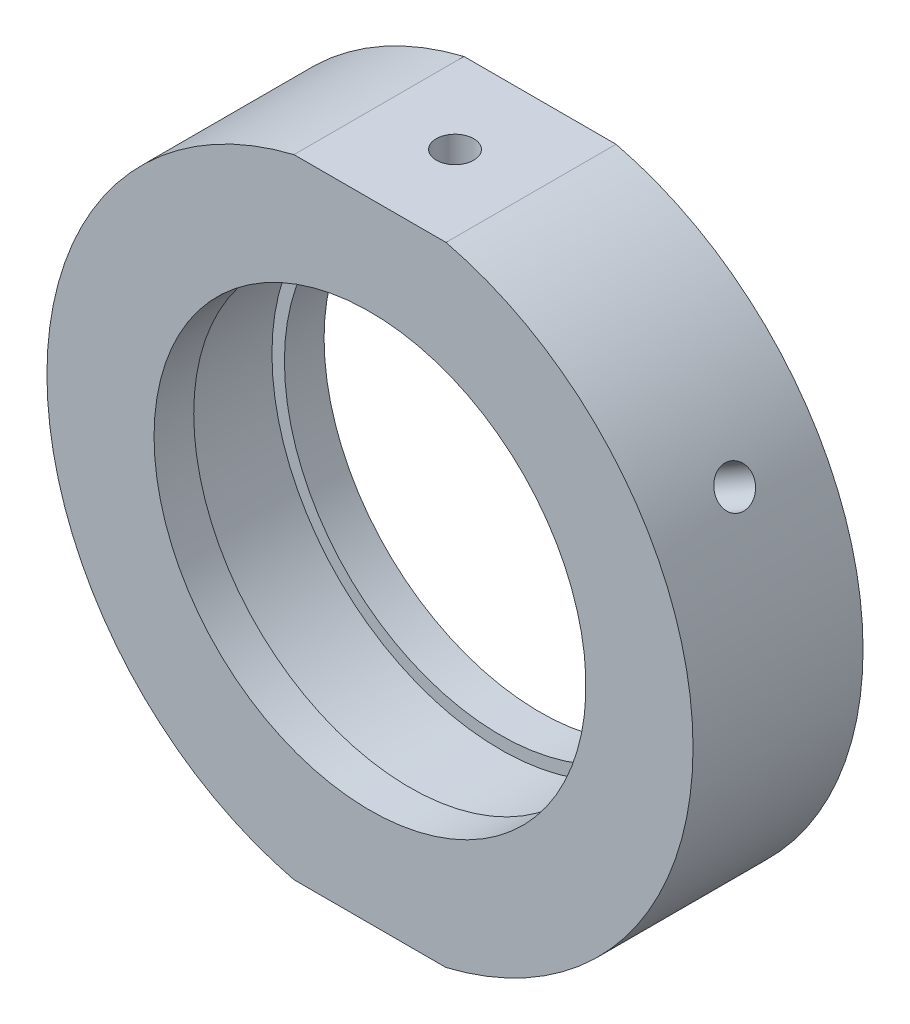
ISO-10303-21;
HEADER;
FILE_DESCRIPTION(('STEP AP214'),'2;1');
FILE_NAME('part.step','',(''),(''),'','','');
FILE_SCHEMA(('AUTOMOTIVE_DESIGN { 1 0 10303 214 1 1 1 1 }'));
ENDSEC;
DATA;
#1=APPLICATION_CONTEXT('core data for automotive mechanical design processes');
#2=APPLICATION_PROTOCOL_DEFINITION('international standard','automotive_design',2000,#1);
#3=PRODUCT_CONTEXT('',#1,'mechanical');
#4=PRODUCT('Part','Part','',(#3));
#5=PRODUCT_RELATED_PRODUCT_CATEGORY('part','',(#4));
#6=PRODUCT_DEFINITION_FORMATION('','',#4);
#7=PRODUCT_DEFINITION_CONTEXT('part definition',#1,'design');
#8=PRODUCT_DEFINITION('design','',#6,#7);
#9=PRODUCT_DEFINITION_SHAPE('','',#8);
#10=(LENGTH_UNIT() NAMED_UNIT(*) SI_UNIT(.MILLI.,.METRE.));
#11=(NAMED_UNIT(*) PLANE_ANGLE_UNIT() SI_UNIT($,.RADIAN.));
#12=(NAMED_UNIT(*) SI_UNIT($,.STERADIAN.) SOLID_ANGLE_UNIT());
#13=UNCERTAINTY_MEASURE_WITH_UNIT(LENGTH_MEASURE(1.E-05),#10,'distance_accuracy_value','');
#14=(GEOMETRIC_REPRESENTATION_CONTEXT(3) GLOBAL_UNCERTAINTY_ASSIGNED_CONTEXT((#13)) GLOBAL_UNIT_ASSIGNED_CONTEXT((#10,
#11,#12)) REPRESENTATION_CONTEXT('',''));
#15=CARTESIAN_POINT('',(0.,0.,0.));
#16=DIRECTION('',(0.,0.,1.));
#17=DIRECTION('',(1.,0.,0.));
#18=AXIS2_PLACEMENT_3D('',#15,#16,#17);
#19=CARTESIAN_POINT('',(0.,0.,-31.9390681003584));
#20=DIRECTION('',(0.,0.,-1.));
#21=DIRECTION('',(-1.,0.,0.));
#22=AXIS2_PLACEMENT_3D('',#19,#20,#21);
#23=CYLINDRICAL_SURFACE('',#22,28.5);
#24=CARTESIAN_POINT('',(23.8153251804841,15.6550402921169,0.));
#25=CARTESIAN_POINT('',(23.8153277749308,15.6550370795243,-0.0925978594208507));
#26=CARTESIAN_POINT('',(23.8196314005314,15.648495501609,-0.185260883687119));
#27=CARTESIAN_POINT('',(23.8367053720121,15.6224745102445,-0.368029223496932));
#28=CARTESIAN_POINT('',(23.8494856204936,15.6029799647694,-0.458131418877637));
#29=CARTESIAN_POINT('',(23.883047908846,15.5515581135897,-0.633104162038931));
#30=CARTESIAN_POINT('',(23.9038257819431,15.5196372818995,-0.717977407442433));
#31=CARTESIAN_POINT('',(23.9526385469314,15.4441935848521,-0.880112571888854));
#32=CARTESIAN_POINT('',(23.9806717568717,15.4006734084152,-0.957376249277912));
#33=CARTESIAN_POINT('',(24.0430562144596,15.3030975605881,-1.10222274019426));
#34=CARTESIAN_POINT('',(24.0774147044993,15.249029808035,-1.16979429691297));
#35=CARTESIAN_POINT('',(24.1512594901974,15.1318027254734,-1.29324222428016));
#36=CARTESIAN_POINT('',(24.1907459978167,15.0686430196475,-1.34911811125169));
#37=CARTESIAN_POINT('',(24.2735675116473,14.9348620430341,-1.44762184788487));
#38=CARTESIAN_POINT('',(24.3169051374035,14.8642356871119,-1.49024058992058));
#39=CARTESIAN_POINT('',(24.4060146047625,14.7174662889455,-1.56096188486543));
#40=CARTESIAN_POINT('',(24.4517864233173,14.6413232989326,-1.58906457519159));
#41=CARTESIAN_POINT('',(24.5442958347122,14.485707503826,-1.62992536658153));
#42=CARTESIAN_POINT('',(24.5910322755923,14.4062385658194,-1.6427008024291));
#43=CARTESIAN_POINT('',(24.6841374618096,14.2461199296046,-1.65259795617057));
#44=CARTESIAN_POINT('',(24.7305062107939,14.1654702431304,-1.64971982952272));
#45=CARTESIAN_POINT('',(24.8215140418881,14.0053886164006,-1.62840588898168));
#46=CARTESIAN_POINT('',(24.8661551305039,13.9259553324556,-1.60998872611444));
#47=CARTESIAN_POINT('',(24.9525779635914,13.7705035188194,-1.55814843979011));
#48=CARTESIAN_POINT('',(24.9943596930856,13.6944850070158,-1.52472523773761));
#49=CARTESIAN_POINT('',(25.074039297685,13.5480446573406,-1.4438004575266));
#50=CARTESIAN_POINT('',(25.1119348175524,13.4776262191303,-1.39629040910615));
#51=CARTESIAN_POINT('',(25.1829180740113,13.3445245637642,-1.28854674262331));
#52=CARTESIAN_POINT('',(25.216005764436,13.2818414208868,-1.2283130023963));
#53=CARTESIAN_POINT('',(25.276680390478,13.1660062212325,-1.0967263901019));
#54=CARTESIAN_POINT('',(25.3042591835338,13.1128682844896,-1.02535733248248));
#55=CARTESIAN_POINT('',(25.3532699045685,13.0178559055621,-0.873582757263182));
#56=CARTESIAN_POINT('',(25.3747018304519,12.9759814672176,-0.793177236582499));
#57=CARTESIAN_POINT('',(25.4109837632356,12.9047862721655,-0.625601997467238));
#58=CARTESIAN_POINT('',(25.4258334645658,12.8754660982736,-0.538431965220725));
#59=CARTESIAN_POINT('',(25.4486562491563,12.8302977764119,-0.359806768278471));
#60=CARTESIAN_POINT('',(25.4566294017861,12.8144494925396,-0.268351646819872));
#61=CARTESIAN_POINT('',(25.465538390234,12.7967360980451,-0.083894449338307));
#62=CARTESIAN_POINT('',(25.4664844223332,12.794850727388,0.00910518900747107));
#63=CARTESIAN_POINT('',(25.4613479608896,12.8050689748372,0.194136416173908));
#64=CARTESIAN_POINT('',(25.4552654986569,12.8171725306264,0.286168009305117));
#65=CARTESIAN_POINT('',(25.4361958173778,12.8549751225273,0.466586842761183));
#66=CARTESIAN_POINT('',(25.4232133159397,12.8806648695991,0.554976528647747));
#67=CARTESIAN_POINT('',(25.3905999866401,12.9448337250359,0.725677915191169));
#68=CARTESIAN_POINT('',(25.3709691070619,12.9833129328883,0.807989568561868));
#69=CARTESIAN_POINT('',(25.325426555806,13.0719258258635,0.964302442341509));
#70=CARTESIAN_POINT('',(25.299507674783,13.1220728857392,1.03829397999781));
#71=CARTESIAN_POINT('',(25.2419427594548,13.2324672925696,1.17576878931791));
#72=CARTESIAN_POINT('',(25.2102966767578,13.2927147248668,1.23925197218311));
#73=CARTESIAN_POINT('',(25.1419318668708,13.4215713534383,1.35398434922265));
#74=CARTESIAN_POINT('',(25.1052071503995,13.490190411028,1.40521890087996));
#75=CARTESIAN_POINT('',(25.0275705469147,13.6336846873921,1.49389949694827));
#76=CARTESIAN_POINT('',(24.9866586827456,13.7085598720337,1.53134561658169));
#77=CARTESIAN_POINT('',(24.9016885882841,13.8623089314004,1.59136086739738));
#78=CARTESIAN_POINT('',(24.8576323454282,13.9411802713268,1.61393930515066));
#79=CARTESIAN_POINT('',(24.7675098427044,14.1006681486337,1.64360873795477));
#80=CARTESIAN_POINT('',(24.7214435992881,14.1812846717273,1.65069985974244));
#81=CARTESIAN_POINT('',(24.6286511043687,14.3418314405987,1.6491921616015));
#82=CARTESIAN_POINT('',(24.5819259168648,14.4217625177426,1.64061627710614));
#83=CARTESIAN_POINT('',(24.4891127337376,14.578809299921,1.6080655031604));
#84=CARTESIAN_POINT('',(24.4430247392691,14.6559249998534,1.58409058580486));
#85=CARTESIAN_POINT('',(24.3528909190879,14.805212368933,1.52142731292838));
#86=CARTESIAN_POINT('',(24.3088450919138,14.8773840416183,1.4827389679373));
#87=CARTESIAN_POINT('',(24.2241909586551,15.014829187217,1.39175049167336));
#88=CARTESIAN_POINT('',(24.1835825570161,15.0801028518958,1.33945073893903));
#89=CARTESIAN_POINT('',(24.1070787364025,15.2021036707577,1.2226400736398));
#90=CARTESIAN_POINT('',(24.071189757745,15.2588191613504,1.15811276186068));
#91=CARTESIAN_POINT('',(24.0053942654022,15.3621225072457,1.01869728937211));
#92=CARTESIAN_POINT('',(23.9754892210139,15.4087078754379,0.94380659165079));
#93=CARTESIAN_POINT('',(23.9226815656073,15.4905677684456,0.785715198598314));
#94=CARTESIAN_POINT('',(23.8997869013468,15.5258294592687,0.702505213408065));
#95=CARTESIAN_POINT('',(23.8618810776424,15.5840254408833,0.53026564620262));
#96=CARTESIAN_POINT('',(23.846860654162,15.6069742185544,0.441243042086115));
#97=CARTESIAN_POINT('',(23.8291633179954,15.6339733166283,0.293060355475162));
#98=CARTESIAN_POINT('',(23.82398218144,15.6418641270648,0.234858919179984));
#99=CARTESIAN_POINT('',(23.8170622895183,15.6523986335215,0.117780444365869));
#100=CARTESIAN_POINT('',(23.815323530103,15.6550423357132,0.0589034066416474));
#101=CARTESIAN_POINT('',(23.8153251804841,15.6550402921169,0.));
#102=B_SPLINE_CURVE_WITH_KNOTS('',3,(#24,#25,#26,#27,#28,#29,#30,#31,#32,#33,#34,#35,#36,#37,
#38,#39,#40,#41,#42,#43,#44,#45,#46,#47,#48,#49,#50,#51,#52,#53,#54,#55,#56,#57,#58,#59,#60,#61,
#62,#63,#64,#65,#66,#67,#68,#69,#70,#71,#72,#73,#74,#75,#76,#77,#78,#79,#80,#81,#82,#83,#84,#85,
#86,#87,#88,#89,#90,#91,#92,#93,#94,#95,#96,#97,#98,#99,#100,#101),.UNSPECIFIED.,.T.,.F.,(4,2,2,
2,2,2,2,2,2,2,2,2,2,2,2,2,2,2,2,2,2,2,2,2,2,2,2,2,2,2,2,2,2,2,2,2,2,2,4),(0.,0.277578549691202,
0.555481946042684,0.833240749883355,1.11093522055068,1.38894964922938,1.6669755729844,
1.94519208016562,2.22340595354616,2.5013048757095,2.77920103801548,3.05676412385136,
3.33432866346455,3.61206043913667,3.88979488153022,4.16793684700293,4.44607890730273,
4.72423387859201,5.00238604386322,5.28013453415683,5.55788178715729,5.83543938610867,
6.1129991441881,6.39087864776975,6.6687604993925,6.94697289965534,7.22518378211565,
7.5032203497858,7.78125464220028,8.05888223740865,8.33651033571789,8.61413823533922,
8.89175841484567,9.16975359929351,9.44781695923016,9.72619436645998,10.0042435237498,
10.1808171672527,10.357390603072),.UNSPECIFIED.);
#103=CARTESIAN_POINT('',(23.8153251804841,15.6550402921169,0.));
#104=VERTEX_POINT('',#103);
#105=EDGE_CURVE('E11',#104,#104,#102,.T.);
#106=ORIENTED_EDGE('',*,*,#105,.T.);
#107=EDGE_LOOP('',(#106));
#108=FACE_BOUND('',#107,.T.);
#109=CARTESIAN_POINT('',(0.,0.,7.50000000000001));
#110=DIRECTION('',(0.,0.,-1.));
#111=DIRECTION('',(-1.,0.,0.));
#112=AXIS2_PLACEMENT_3D('',#109,#110,#111);
#113=CIRCLE('',#112,28.5);
#114=CARTESIAN_POINT('',(6.7052218456961,27.7,7.5));
#115=VERTEX_POINT('',#114);
#116=CARTESIAN_POINT('',(6.7052218456961,-27.7,7.50000000000001));
#117=VERTEX_POINT('',#116);
#118=EDGE_CURVE('E144',#115,#117,#113,.T.);
#119=ORIENTED_EDGE('',*,*,#118,.T.);
#120=DIRECTION('',(0.,0.,-1.));
#121=VECTOR('',#120,1.);
#122=CARTESIAN_POINT('',(6.7052218456961,-27.7,-31.9390681003584));
#123=LINE('',#122,#121);
#124=CARTESIAN_POINT('',(6.70522184569608,-27.7,-7.5));
#125=VERTEX_POINT('',#124);
#126=EDGE_CURVE('E57',#117,#125,#123,.T.);
#127=ORIENTED_EDGE('',*,*,#126,.T.);
#128=CARTESIAN_POINT('',(0.,0.,-7.5));
#129=DIRECTION('',(0.,0.,-1.));
#130=DIRECTION('',(-1.,0.,0.));
#131=AXIS2_PLACEMENT_3D('',#128,#129,#130);
#132=CIRCLE('',#131,28.5);
#133=CARTESIAN_POINT('',(6.7052218456961,27.7,-7.49999999999999));
#134=VERTEX_POINT('',#133);
#135=EDGE_CURVE('E148',#134,#125,#132,.T.);
#136=ORIENTED_EDGE('',*,*,#135,.F.);
#137=DIRECTION('',(0.,0.,-1.));
#138=VECTOR('',#137,1.);
#139=CARTESIAN_POINT('',(6.7052218456961,27.7,-31.9390681003584));
#140=LINE('',#139,#138);
#141=EDGE_CURVE('E118',#134,#115,#140,.F.);
#142=ORIENTED_EDGE('',*,*,#141,.T.);
#143=EDGE_LOOP('',(#119,#127,#136,#142));
#144=FACE_BOUND('',#143,.T.);
#145=ADVANCED_FACE('F37',(#108,#144),#23,.T.);
#146=CARTESIAN_POINT('',(19.05,0.,-7.5));
#147=DIRECTION('',(0.,0.,1.));
#148=DIRECTION('',(1.,0.,0.));
#149=AXIS2_PLACEMENT_3D('',#146,#147,#148);
#150=PLANE('',#149);
#151=CARTESIAN_POINT('',(0.,0.,-7.5));
#152=DIRECTION('',(0.,0.,-1.));
#153=DIRECTION('',(-1.,0.,0.));
#154=AXIS2_PLACEMENT_3D('',#151,#152,#153);
#155=CIRCLE('',#154,19.05);
#156=CARTESIAN_POINT('',(-19.05,0.,-7.5));
#157=VERTEX_POINT('',#156);
#158=EDGE_CURVE('E126',#157,#157,#155,.T.);
#159=ORIENTED_EDGE('',*,*,#158,.F.);
#160=EDGE_LOOP('',(#159));
#161=FACE_BOUND('',#160,.T.);
#162=ORIENTED_EDGE('',*,*,#135,.T.);
#163=DIRECTION('',(-1.,0.,0.));
#164=VECTOR('',#163,1.);
#165=CARTESIAN_POINT('',(19.05,-27.7,-7.5));
#166=LINE('',#165,#164);
#167=CARTESIAN_POINT('',(-6.7052218456961,-27.7,-7.49999999999999));
#168=VERTEX_POINT('',#167);
#169=EDGE_CURVE('E114',#125,#168,#166,.T.);
#170=ORIENTED_EDGE('',*,*,#169,.T.);
#171=CARTESIAN_POINT('',(-6.70522184569608,27.7,-7.5));
#172=VERTEX_POINT('',#171);
#173=EDGE_CURVE('E147',#168,#172,#132,.T.);
#174=ORIENTED_EDGE('',*,*,#173,.T.);
#175=DIRECTION('',(1.,0.,0.));
#176=VECTOR('',#175,1.);
#177=CARTESIAN_POINT('',(19.05,27.7,-7.5));
#178=LINE('',#177,#176);
#179=EDGE_CURVE('E121',#172,#134,#178,.T.);
#180=ORIENTED_EDGE('',*,*,#179,.T.);
#181=EDGE_LOOP('',(#162,#170,#174,#180));
#182=FACE_BOUND('',#181,.T.);
#183=ADVANCED_FACE('F39',(#161,#182),#150,.F.);
#184=CARTESIAN_POINT('',(-25.4653251804841,12.7971564596282,0.));
#185=CARTESIAN_POINT('',(-25.4653236955207,12.7971603127813,-0.0925978594208504));
#186=CARTESIAN_POINT('',(-25.4618103356655,12.8041581508374,-0.185260883687118));
#187=CARTESIAN_POINT('',(-25.4478124818525,12.8319551395655,-0.368029223496932));
#188=CARTESIAN_POINT('',(-25.4373198344766,12.8527704321546,-0.458131418877637));
#189=CARTESIAN_POINT('',(-25.4095683492215,12.9075471520668,-0.633104162038931));
#190=CARTESIAN_POINT('',(-25.3923130346165,12.9415017338507,-0.717977407442435));
#191=CARTESIAN_POINT('',(-25.3513832589122,13.0214966768832,-0.880112571888855));
#192=CARTESIAN_POINT('',(-25.3277102855108,13.0675342370595,-0.957376249277913));
#193=CARTESIAN_POINT('',(-25.2743993512906,13.1703486860455,-1.10222274019426));
#194=CARTESIAN_POINT('',(-25.2447545490739,13.2271378875321,-1.16979429691297));
#195=CARTESIAN_POINT('',(-25.1801553104131,13.3497028891645,-1.29324222428016));
#196=CARTESIAN_POINT('',(-25.145200654482,13.4154790607825,-1.34911811125169));
#197=CARTESIAN_POINT('',(-25.070753687107,13.5540950840463,-1.44762184788487));
#198=CARTESIAN_POINT('',(-25.0312582815798,13.626939746852,-1.49024058992058));
#199=CARTESIAN_POINT('',(-24.948706987949,13.7774955083858,-1.56096188486543));
#200=CARTESIAN_POINT('',(-24.9056511335551,13.8552065610382,-1.58906457519159));
#201=CARTESIAN_POINT('',(-24.8171386074601,14.0131299589486,-1.62992536658153));
#202=CARTESIAN_POINT('',(-24.7716847087747,14.0933393730365,-1.6427008024291));
#203=CARTESIAN_POINT('',(-24.679570495302,14.2540301476322,-1.65259795617057));
#204=CARTESIAN_POINT('',(-24.6329101925002,14.3345115054314,-1.64971982952272));
#205=CARTESIAN_POINT('',(-24.5397793526202,14.4933674124672,-1.62840588898168));
#206=CARTESIAN_POINT('',(-24.4933086551257,14.5717443712336,-1.60998872611444));
#207=CARTESIAN_POINT('',(-24.4018948519962,14.7243146469725,-1.55814843979012));
#208=CARTESIAN_POINT('',(-24.3569517543635,14.7985079420303,-1.52472523773762));
#209=CARTESIAN_POINT('',(-24.2699704937053,14.9407326786145,-1.4438004575266));
#210=CARTESIAN_POINT('',(-24.2279340972541,15.0087603806144,-1.39629040910615));
#211=CARTESIAN_POINT('',(-24.1481563106508,15.1367845116342,-1.28854674262331));
#212=CARTESIAN_POINT('',(-24.1104149617422,15.1967808635333,-1.2283130023963));
#213=CARTESIAN_POINT('',(-24.0404360492101,15.3072442308779,-1.0967263901019));
#214=CARTESIAN_POINT('',(-24.008206642614,15.3576971346413,-1.02535733248248));
#215=CARTESIAN_POINT('',(-23.9504288693062,15.447647853579,-0.873582757263181));
#216=CARTESIAN_POINT('',(-23.9248805048723,15.4871456650182,-0.793177236582498));
#217=CARTESIAN_POINT('',(-23.8813646237216,15.5541643380334,-0.625601997467237));
#218=CARTESIAN_POINT('',(-23.863397458953,15.5816846435699,-0.538431965220724));
#219=CARTESIAN_POINT('',(-23.8356919370697,15.6240339157412,-0.359806768278469));
#220=CARTESIAN_POINT('',(-23.8259534969449,15.6388630104031,-0.268351646819871));
#221=CARTESIAN_POINT('',(-23.8150677415492,15.6554351179682,-0.083894449338307));
#222=CARTESIAN_POINT('',(-23.8139079787142,15.6571970911275,0.00910518900747112));
#223=CARTESIAN_POINT('',(-23.8201890098656,15.6476396613071,0.194136416173908));
#224=CARTESIAN_POINT('',(-23.8276297655388,15.6363203166015,0.286168009305117));
#225=CARTESIAN_POINT('',(-23.8508329298143,15.6009041922212,0.466586842761183));
#226=CARTESIAN_POINT('',(-23.8665896526762,15.5768161426353,0.554976528647747));
#227=CARTESIAN_POINT('',(-23.9058548469666,15.5164877432414,0.725677915191169));
#228=CARTESIAN_POINT('',(-23.9293633786951,15.4802472989019,0.807989568561868));
#229=CARTESIAN_POINT('',(-23.9833331194865,15.3964998460735,0.964302442341509));
#230=CARTESIAN_POINT('',(-24.0138023067524,15.3489799067321,1.03829397999781));
#231=CARTESIAN_POINT('',(-24.0806242098392,15.2439300242759,1.17576878931791));
#232=CARTESIAN_POINT('',(-24.1169769753729,15.1863999965815,1.23925197218311));
#233=CARTESIAN_POINT('',(-24.1943876842183,15.0627660202087,1.35398434922265));
#234=CARTESIAN_POINT('',(-24.2354511730391,14.9966519540029,1.40521890087996));
#235=CARTESIAN_POINT('',(-24.3209025599257,14.8576695449395,1.49389949694827));
#236=CARTESIAN_POINT('',(-24.3652904398538,14.7848012389321,1.53134561658169));
#237=CARTESIAN_POINT('',(-24.4559559838425,14.6343404488831,1.59136086739738));
#238=CARTESIAN_POINT('',(-24.5022324464214,14.5567509534114,1.61393930515066));
#239=CARTESIAN_POINT('',(-24.5952917484029,14.3989586379466,1.64360873795477));
#240=CARTESIAN_POINT('',(-24.6420745836586,14.3187558393443,1.65069985974244));
#241=CARTESIAN_POINT('',(-24.734715916537,14.1581217970279,1.6491921616015));
#242=CARTESIAN_POINT('',(-24.7805756661436,14.077691059081,1.64061627710614));
#243=CARTESIAN_POINT('',(-24.8701755775291,13.9187890935975,1.6080655031604));
#244=CARTESIAN_POINT('',(-24.9139157354669,13.840317869612,1.58409058580486));
#245=CARTESIAN_POINT('',(-24.9981354794634,13.6876160070553,1.52142731292838));
#246=CARTESIAN_POINT('',(-25.0386150678554,13.6133853654491,1.4827389679373));
#247=CARTESIAN_POINT('',(-25.1153189889414,13.4713501627124,1.39175049167336));
#248=CARTESIAN_POINT('',(-25.1515434399318,13.4035454229466,1.33945073893903));
#249=CARTESIAN_POINT('',(-25.218947338042,13.2762907613776,1.2226400736398));
#250=CARTESIAN_POINT('',(-25.2501199043546,13.216852248848,1.15811276186068));
#251=CARTESIAN_POINT('',(-25.3066854800244,13.108220008077,1.01869728937211));
#252=CARTESIAN_POINT('',(-25.3320770701294,13.0590287958393,0.943806591650791));
#253=CARTESIAN_POINT('',(-25.3765659893218,12.972366078239,0.785715198598314));
#254=CARTESIAN_POINT('',(-25.3956561772248,12.9349078719668,0.702505213408066));
#255=CARTESIAN_POINT('',(-25.427102463849,12.8729824748801,0.53026564620262));
#256=CARTESIAN_POINT('',(-25.4394664765578,12.848500017735,0.441243042086115));
#257=CARTESIAN_POINT('',(-25.4539997132857,12.8196741259984,0.293060355475161));
#258=CARTESIAN_POINT('',(-25.4582427873025,12.8112417249027,0.234858919179984));
#259=CARTESIAN_POINT('',(-25.4639059915494,12.7999816694787,0.11778044436587));
#260=CARTESIAN_POINT('',(-25.4653261250999,12.7971540085582,0.0589034066416476));
#261=CARTESIAN_POINT('',(-25.4653251804841,12.7971564596282,0.));
#262=B_SPLINE_CURVE_WITH_KNOTS('',3,(#184,#185,#186,#187,#188,#189,#190,#191,#192,#193,#194,
#195,#196,#197,#198,#199,#200,#201,#202,#203,#204,#205,#206,#207,#208,#209,#210,#211,#212,#213,
#214,#215,#216,#217,#218,#219,#220,#221,#222,#223,#224,#225,#226,#227,#228,#229,#230,#231,#232,
#233,#234,#235,#236,#237,#238,#239,#240,#241,#242,#243,#244,#245,#246,#247,#248,#249,#250,#251,
#252,#253,#254,#255,#256,#257,#258,#259,#260,#261),.UNSPECIFIED.,.T.,.F.,(4,2,2,2,2,2,2,2,2,2,2,
2,2,2,2,2,2,2,2,2,2,2,2,2,2,2,2,2,2,2,2,2,2,2,2,2,2,2,4),(0.,0.277578549691202,
0.555481946042684,0.833240749883357,1.11093522055068,1.38894964922938,1.6669755729844,
1.94519208016562,2.22340595354617,2.5013048757095,2.77920103801547,3.05676412385136,
3.33432866346455,3.61206043913667,3.88979488153022,4.16793684700293,4.44607890730273,
4.72423387859201,5.00238604386322,5.28013453415683,5.55788178715729,5.83543938610867,
6.1129991441881,6.39087864776975,6.6687604993925,6.94697289965534,7.22518378211565,
7.5032203497858,7.78125464220028,8.05888223740866,8.3365103357179,8.61413823533922,
8.89175841484568,9.16975359929351,9.44781695923016,9.72619436645998,10.0042435237498,
10.1808171672527,10.357390603072),.UNSPECIFIED.);
#263=CARTESIAN_POINT('',(-25.4653251804841,12.7971564596282,0.));
#264=VERTEX_POINT('',#263);
#265=EDGE_CURVE('E172',#264,#264,#262,.T.);
#266=ORIENTED_EDGE('',*,*,#265,.T.);
#267=EDGE_LOOP('',(#266));
#268=FACE_BOUND('',#267,.T.);
#269=ORIENTED_EDGE('',*,*,#173,.F.);
#270=DIRECTION('',(0.,0.,-1.));
#271=VECTOR('',#270,1.);
#272=CARTESIAN_POINT('',(-6.7052218456961,-27.7,-31.9390681003584));
#273=LINE('',#272,#271);
#274=CARTESIAN_POINT('',(-6.70522184569609,-27.7,7.5));
#275=VERTEX_POINT('',#274);
#276=EDGE_CURVE('E112',#168,#275,#273,.F.);
#277=ORIENTED_EDGE('',*,*,#276,.T.);
#278=CARTESIAN_POINT('',(-6.70522184569609,27.7,7.50000000000001));
#279=VERTEX_POINT('',#278);
#280=EDGE_CURVE('E65',#275,#279,#113,.T.);
#281=ORIENTED_EDGE('',*,*,#280,.T.);
#282=DIRECTION('',(0.,0.,-1.));
#283=VECTOR('',#282,1.);
#284=CARTESIAN_POINT('',(-6.7052218456961,27.7,-31.9390681003584));
#285=LINE('',#284,#283);
#286=EDGE_CURVE('E124',#279,#172,#285,.T.);
#287=ORIENTED_EDGE('',*,*,#286,.T.);
#288=EDGE_LOOP('',(#269,#277,#281,#287));
#289=FACE_BOUND('',#288,.T.);
#290=ADVANCED_FACE('F157',(#268,#289),#23,.T.);
#291=CARTESIAN_POINT('',(28.5,0.,7.5));
#292=DIRECTION('',(0.,0.,-1.));
#293=DIRECTION('',(-1.,0.,0.));
#294=AXIS2_PLACEMENT_3D('',#291,#292,#293);
#295=PLANE('',#294);
#296=ORIENTED_EDGE('',*,*,#280,.F.);
#297=DIRECTION('',(1.,0.,0.));
#298=VECTOR('',#297,1.);
#299=CARTESIAN_POINT('',(28.5,-27.7,7.5));
#300=LINE('',#299,#298);
#301=EDGE_CURVE('E50',#275,#117,#300,.T.);
#302=ORIENTED_EDGE('',*,*,#301,.T.);
#303=ORIENTED_EDGE('',*,*,#118,.F.);
#304=DIRECTION('',(-1.,0.,0.));
#305=VECTOR('',#304,1.);
#306=CARTESIAN_POINT('',(28.5,27.7,7.5));
#307=LINE('',#306,#305);
#308=EDGE_CURVE('E151',#115,#279,#307,.T.);
#309=ORIENTED_EDGE('',*,*,#308,.T.);
#310=EDGE_LOOP('',(#296,#302,#303,#309));
#311=FACE_BOUND('',#310,.T.);
#312=CARTESIAN_POINT('',(0.,0.,7.5));
#313=DIRECTION('',(0.,0.,-1.));
#314=DIRECTION('',(-1.,0.,0.));
#315=AXIS2_PLACEMENT_3D('',#312,#313,#314);
#316=CIRCLE('',#315,19.05);
#317=CARTESIAN_POINT('',(-19.05,0.,7.5));
#318=VERTEX_POINT('',#317);
#319=EDGE_CURVE('E141',#318,#318,#316,.T.);
#320=ORIENTED_EDGE('',*,*,#319,.T.);
#321=EDGE_LOOP('',(#320));
#322=FACE_BOUND('',#321,.T.);
#323=ADVANCED_FACE('F190',(#311,#322),#295,.F.);
#324=CARTESIAN_POINT('',(0.,0.,-31.9390681003584));
#325=DIRECTION('',(0.,0.,-1.));
#326=DIRECTION('',(-1.,0.,0.));
#327=AXIS2_PLACEMENT_3D('',#324,#325,#326);
#328=CYLINDRICAL_SURFACE('',#327,19.05);
#329=ORIENTED_EDGE('',*,*,#319,.F.);
#330=EDGE_LOOP('',(#329));
#331=FACE_BOUND('',#330,.T.);
#332=CARTESIAN_POINT('',(0.,0.,4.));
#333=DIRECTION('',(0.,0.,-1.));
#334=DIRECTION('',(-1.,0.,0.));
#335=AXIS2_PLACEMENT_3D('',#332,#333,#334);
#336=CIRCLE('',#335,19.05);
#337=CARTESIAN_POINT('',(-19.05,0.,4.));
#338=VERTEX_POINT('',#337);
#339=EDGE_CURVE('E138',#338,#338,#336,.T.);
#340=ORIENTED_EDGE('',*,*,#339,.T.);
#341=EDGE_LOOP('',(#340));
#342=FACE_BOUND('',#341,.T.);
#343=ADVANCED_FACE('F187',(#331,#342),#328,.F.);
#344=CARTESIAN_POINT('',(19.05,0.,4.));
#345=DIRECTION('',(0.,0.,1.));
#346=DIRECTION('',(1.,0.,0.));
#347=AXIS2_PLACEMENT_3D('',#344,#345,#346);
#348=PLANE('',#347);
#349=ORIENTED_EDGE('',*,*,#339,.F.);
#350=EDGE_LOOP('',(#349));
#351=FACE_BOUND('',#350,.T.);
#352=CARTESIAN_POINT('',(0.,0.,4.));
#353=DIRECTION('',(0.,0.,-1.));
#354=DIRECTION('',(-1.,0.,0.));
#355=AXIS2_PLACEMENT_3D('',#352,#353,#354);
#356=CIRCLE('',#355,20.15);
#357=CARTESIAN_POINT('',(-20.15,0.,4.));
#358=VERTEX_POINT('',#357);
#359=EDGE_CURVE('E135',#358,#358,#356,.T.);
#360=ORIENTED_EDGE('',*,*,#359,.T.);
#361=EDGE_LOOP('',(#360));
#362=FACE_BOUND('',#361,.T.);
#363=ADVANCED_FACE('F181',(#351,#362),#348,.F.);
#364=CARTESIAN_POINT('',(0.,0.,-31.9390681003584));
#365=DIRECTION('',(0.,0.,-1.));
#366=DIRECTION('',(-1.,0.,0.));
#367=AXIS2_PLACEMENT_3D('',#364,#365,#366);
#368=CYLINDRICAL_SURFACE('',#367,20.15);
#369=CARTESIAN_POINT('',(-18.216808416608,8.61222335477885,0.));
#370=CARTESIAN_POINT('',(-18.2168071717094,8.61222730548486,0.0925143759811272));
#371=CARTESIAN_POINT('',(-18.2134645141771,8.6193075003637,0.185091875761763));
#372=CARTESIAN_POINT('',(-18.2001329981117,8.64742109177869,0.367685787677286));
#373=CARTESIAN_POINT('',(-18.1901365926905,8.66847033236071,0.457699170479254));
#374=CARTESIAN_POINT('',(-18.1636511344035,8.7238302026295,0.632493822109131));
#375=CARTESIAN_POINT('',(-18.1471657423378,8.75813335484333,0.717278009877315));
#376=CARTESIAN_POINT('',(-18.1079671408111,8.83889308801043,0.879252633503245));
#377=CARTESIAN_POINT('',(-18.0852552701704,8.88534705619119,0.956444696980378));
#378=CARTESIAN_POINT('',(-18.0339280319583,8.98906475398761,1.10125591015014));
#379=CARTESIAN_POINT('',(-18.0052997781153,9.04635205578129,1.16885361129772));
#380=CARTESIAN_POINT('',(-17.9426947286032,9.16989593747247,1.29237302908199));
#381=CARTESIAN_POINT('',(-17.9087177002172,9.23615290760904,1.34829423744584));
#382=CARTESIAN_POINT('',(-17.8360505949508,9.37571264935142,1.44694431345597));
#383=CARTESIAN_POINT('',(-17.7973540094767,9.44902512092919,1.48965466893051));
#384=CARTESIAN_POINT('',(-17.71615157623,9.60040849311726,1.56055223096121));
#385=CARTESIAN_POINT('',(-17.673645793103,9.67847931296674,1.58873968392989));
#386=CARTESIAN_POINT('',(-17.585971954807,9.83688274702673,1.62972968782681));
#387=CARTESIAN_POINT('',(-17.5408101364341,9.91720984811717,1.64256688047847));
#388=CARTESIAN_POINT('',(-17.4489480772331,10.0779600723713,1.65259904373962));
#389=CARTESIAN_POINT('',(-17.4022478641435,10.1583831937785,1.64979429623332));
#390=CARTESIAN_POINT('',(-17.3087709252889,10.3168500072012,1.62865054494948));
#391=CARTESIAN_POINT('',(-17.2619946512654,10.3948989407572,1.6103487938979));
#392=CARTESIAN_POINT('',(-17.1696858574897,10.5466716150568,1.55878847073777));
#393=CARTESIAN_POINT('',(-17.1241533492294,10.6203953158442,1.52552976048226));
#394=CARTESIAN_POINT('',(-17.0357480498084,10.7616330359521,1.44495804026483));
#395=CARTESIAN_POINT('',(-16.9928784925394,10.8291395513177,1.3976283308231));
#396=CARTESIAN_POINT('',(-16.9113056730202,10.9560915943942,1.29027025574449));
#397=CARTESIAN_POINT('',(-16.8726024923454,11.015536964278,1.23024164153786));
#398=CARTESIAN_POINT('',(-16.8006169116254,11.1250207312329,1.09897975583741));
#399=CARTESIAN_POINT('',(-16.7673507543522,11.175031007829,1.02771411696017));
#400=CARTESIAN_POINT('',(-16.7075964564866,11.26417372941,0.876113998459197));
#401=CARTESIAN_POINT('',(-16.6811083212062,11.3033061658697,0.795779511728009));
#402=CARTESIAN_POINT('',(-16.6359098996425,11.369723999364,0.628299466842709));
#403=CARTESIAN_POINT('',(-16.6172005260964,11.3970080061549,0.54115311082799));
#404=CARTESIAN_POINT('',(-16.588292396553,11.4390433113809,0.362533859638641));
#405=CARTESIAN_POINT('',(-16.5780934678756,11.453794864104,0.271061052289039));
#406=CARTESIAN_POINT('',(-16.5666264189945,11.4703745561771,0.0866695714065167));
#407=CARTESIAN_POINT('',(-16.5653324746885,11.4722400646039,-0.00624413748201937));
#408=CARTESIAN_POINT('',(-16.571658226347,11.4631005104668,-0.191129537222039));
#409=CARTESIAN_POINT('',(-16.5792778420768,11.4520955637554,-0.283101236545443));
#410=CARTESIAN_POINT('',(-16.6031126207604,11.4175122856666,-0.463362054967362));
#411=CARTESIAN_POINT('',(-16.6193158372836,11.3939514290038,-0.551656108749794));
#412=CARTESIAN_POINT('',(-16.6596815979082,11.3348481371687,-0.72220810906425));
#413=CARTESIAN_POINT('',(-16.6838442653956,11.299305516257,-0.804465962000007));
#414=CARTESIAN_POINT('',(-16.7392778457669,11.2170198569593,-0.960817803887206));
#415=CARTESIAN_POINT('',(-16.7705649399965,11.1702513084095,-1.03489262939069));
#416=CARTESIAN_POINT('',(-16.8390628414066,11.0667206167782,-1.17258207217325));
#417=CARTESIAN_POINT('',(-16.8762737470404,11.0099583075996,-1.23619651556605));
#418=CARTESIAN_POINT('',(-16.9553896268597,10.8877254360478,-1.35131382461082));
#419=CARTESIAN_POINT('',(-16.9973056425383,10.8222343193818,-1.40278728338108));
#420=CARTESIAN_POINT('',(-17.0843153561747,10.6843486287101,-1.49195975216876));
#421=CARTESIAN_POINT('',(-17.1294090233146,10.6119541216537,-1.52965889575273));
#422=CARTESIAN_POINT('',(-17.2212299452127,10.4622861370419,-1.5901620403067));
#423=CARTESIAN_POINT('',(-17.2679551278308,10.3850187545063,-1.61298425948634));
#424=CARTESIAN_POINT('',(-17.3616267846109,10.227648626743,-1.6431452654181));
#425=CARTESIAN_POINT('',(-17.4085732547273,10.1475459331792,-1.65048433414952));
#426=CARTESIAN_POINT('',(-17.5011657040039,9.98700461812629,-1.64946746949102));
#427=CARTESIAN_POINT('',(-17.5468150853713,9.9065676644983,-1.64115738008657));
#428=CARTESIAN_POINT('',(-17.6357092429086,9.7474390997817,-1.60917364960807));
#429=CARTESIAN_POINT('',(-17.6789540157216,9.66874749112968,-1.58549998708729));
#430=CARTESIAN_POINT('',(-17.7619505791788,9.51541997828316,-1.52347267953603));
#431=CARTESIAN_POINT('',(-17.8017025552251,9.44078385889837,-1.48511981427629));
#432=CARTESIAN_POINT('',(-17.8768076529871,9.29778357104177,-1.39482810906678));
#433=CARTESIAN_POINT('',(-17.9121608477229,9.22941929846179,-1.34288949468586));
#434=CARTESIAN_POINT('',(-17.9778303120726,9.10084351047085,-1.22672863886547));
#435=CARTESIAN_POINT('',(-18.0081322433314,9.04065528994201,-1.16247250716413));
#436=CARTESIAN_POINT('',(-18.0630136609571,8.93050029776728,-1.02356110638499));
#437=CARTESIAN_POINT('',(-18.0875917585868,8.88053600704441,-0.948903320627927));
#438=CARTESIAN_POINT('',(-18.1306293354538,8.79233757990831,-0.791167730369245));
#439=CARTESIAN_POINT('',(-18.1490775802495,8.75412499077274,-0.708074826229332));
#440=CARTESIAN_POINT('',(-18.1794791263306,8.69081604268443,-0.53599448110506));
#441=CARTESIAN_POINT('',(-18.1914399063475,8.66570458206565,-0.447013960745673));
#442=CARTESIAN_POINT('',(-18.2056419434715,8.63581257429338,-0.297922429589513));
#443=CARTESIAN_POINT('',(-18.2098260656707,8.62697964916443,-0.238770704545332));
#444=CARTESIAN_POINT('',(-18.2154097016018,8.61518376819815,-0.119754803131206));
#445=CARTESIAN_POINT('',(-18.2168092225127,8.61222079722751,-0.0598906285984246));
#446=CARTESIAN_POINT('',(-18.216808416608,8.61222335477885,0.));
#447=B_SPLINE_CURVE_WITH_KNOTS('',3,(#369,#370,#371,#372,#373,#374,#375,#376,#377,#378,#379,
#380,#381,#382,#383,#384,#385,#386,#387,#388,#389,#390,#391,#392,#393,#394,#395,#396,#397,#398,
#399,#400,#401,#402,#403,#404,#405,#406,#407,#408,#409,#410,#411,#412,#413,#414,#415,#416,#417,
#418,#419,#420,#421,#422,#423,#424,#425,#426,#427,#428,#429,#430,#431,#432,#433,#434,#435,#436,
#437,#438,#439,#440,#441,#442,#443,#444,#445,#446),.UNSPECIFIED.,.T.,.F.,(4,2,2,2,2,2,2,2,2,2,2,
2,2,2,2,2,2,2,2,2,2,2,2,2,2,2,2,2,2,2,2,2,2,2,2,2,2,2,4),(0.,0.277324458665703,
0.554964004592896,0.832447142508941,1.10987066260477,1.38790492095643,1.66595127950103,
1.94438551338993,2.22281502288311,2.5006149930804,2.7784099570462,3.05553902863921,
3.33267065993209,3.61013251335773,3.88759979835446,4.16588141951651,4.44416325877566,
4.722477741612,5.00078657721148,5.27828798683276,5.55578689856233,5.83290060535933,
6.11001860812507,6.38777240612829,6.66553082085526,6.94395524454922,7.22237696835025,
7.50045709452481,7.77853215625761,8.05579386807381,8.3330559669338,8.61030333945797,
8.88754610904112,9.16556292310787,9.44364712051109,9.72223819907523,10.0005074323079,
10.180038221974,10.3595685487915),.UNSPECIFIED.);
#448=CARTESIAN_POINT('',(-18.216808416608,8.61222335477885,0.));
#449=VERTEX_POINT('',#448);
#450=EDGE_CURVE('E41',#449,#449,#447,.T.);
#451=ORIENTED_EDGE('',*,*,#450,.T.);
#452=EDGE_LOOP('',(#451));
#453=FACE_BOUND('',#452,.T.);
#454=CARTESIAN_POINT('',(16.566808416608,11.4701071872675,0.));
#455=CARTESIAN_POINT('',(16.5668112155705,11.4701041338006,0.0925143759811271));
#456=CARTESIAN_POINT('',(16.5712715154332,11.4636692100221,0.185091875761763));
#457=CARTESIAN_POINT('',(16.5889528417575,11.438066982731,0.367685787677285));
#458=CARTESIAN_POINT('',(16.6021838161212,11.4188852213987,0.457699170479253));
#459=CARTESIAN_POINT('',(16.6368841409807,11.3682682065569,0.63249382210913));
#460=CARTESIAN_POINT('',(16.658348846195,11.3368398621297,0.717278009877314));
#461=CARTESIAN_POINT('',(16.7086895259572,11.2625130108312,0.879252633503244));
#462=CARTESIAN_POINT('',(16.7375639071879,11.2196169697985,0.956444696980377));
#463=CARTESIAN_POINT('',(16.8017224491957,11.1233074287026,1.10125591015014));
#464=CARTESIAN_POINT('',(16.8370205809417,11.0698709827117,1.16885361129772));
#465=CARTESIAN_POINT('',(16.9127101962124,10.9538814785835,1.29237302908199));
#466=CARTESIAN_POINT('',(16.9531019013354,10.8913280237878,1.34829423744584));
#467=CARTESIAN_POINT('',(17.0376306303967,10.7586165937364,1.44694431345597));
#468=CARTESIAN_POINT('',(17.0817728004603,10.6884481318872,1.48965466893051));
#469=CARTESIAN_POINT('',(17.1722734298623,10.5424330757524,1.56055223096121));
#470=CARTESIAN_POINT('',(17.2186318515827,10.466586577832,1.58873968392989));
#471=CARTESIAN_POINT('',(17.3119763303774,10.3114570895904,1.62972968782681));
#472=CARTESIAN_POINT('',(17.3589607313477,10.2321822570531,1.64256688047847));
#473=CARTESIAN_POINT('',(17.4522434796152,10.072252268014,1.65259904373962));
#474=CARTESIAN_POINT('',(17.4985418392607,9.99159713641265,1.64979429623332));
#475=CARTESIAN_POINT('',(17.5890396559143,9.83141032598527,1.62865054494948));
#476=CARTESIAN_POINT('',(17.6332438781003,9.75187641760847,1.6103487938979));
#477=CARTESIAN_POINT('',(17.7185284727562,9.59604832005621,1.55878847073777));
#478=CARTESIAN_POINT('',(17.7596088163689,9.51975416081116,1.52552976048226));
#479=CARTESIAN_POINT('',(17.8377216202445,9.37257406562937,1.44495804026483));
#480=CARTESIAN_POINT('',(17.8747491988376,9.30169468230267,1.39762833082311));
#481=CARTESIAN_POINT('',(17.9439064834445,9.16757452680243,1.29027025574449));
#482=CARTESIAN_POINT('',(17.9760360935639,9.1043339041889,1.23024164153786));
#483=CARTESIAN_POINT('',(18.0348590266889,8.9872506791018,1.09897975583741));
#484=CARTESIAN_POINT('',(18.0615361180347,8.9334362035189,1.02771411696017));
#485=CARTESIAN_POINT('',(18.1088588305536,8.83711610279141,0.876113998459199));
#486=CARTESIAN_POINT('',(18.1295044469995,8.79461048650992,0.79577951172801));
#487=CARTESIAN_POINT('',(18.164424767288,8.72225858847758,0.628299466842709));
#488=CARTESIAN_POINT('',(18.1786987235129,8.69241379230238,0.54115311082799));
#489=CARTESIAN_POINT('',(18.2006483009227,8.64636096512888,0.362533859638641));
#490=CARTESIAN_POINT('',(18.2083240559875,8.63015265744133,0.27106105228904));
#491=CARTESIAN_POINT('',(18.2169489660692,8.6119320557673,0.086669571406518));
#492=CARTESIAN_POINT('',(18.2179175716048,8.60987871291378,-0.00624413748201834));
#493=CARTESIAN_POINT('',(18.213165361372,8.61992675161667,-0.191129537222038));
#494=CARTESIAN_POINT('',(18.2074446058176,8.6320280057614,-0.283101236545442));
#495=CARTESIAN_POINT('',(18.1894119977883,8.66996116863942,-0.463362054967361));
#496=CARTESIAN_POINT('',(18.177109305645,8.69577399410292,-0.551656108749793));
#497=CARTESIAN_POINT('',(18.1461072337808,8.76028341416447,-0.722208109064249));
#498=CARTESIAN_POINT('',(18.1274077548979,8.79898020848758,-0.804465962000006));
#499=CARTESIAN_POINT('',(18.0838630737646,8.88812992696075,-0.960817803887205));
#500=CARTESIAN_POINT('',(18.0590038697372,8.93860961964903,-1.03489262939069));
#501=CARTESIAN_POINT('',(18.0035926114181,9.0496958881918,-1.17258207217325));
#502=CARTESIAN_POINT('',(17.9730404625089,9.11030263235774,-1.23619651556605));
#503=CARTESIAN_POINT('',(17.9067416304772,9.23993542989994,-1.35131382461081));
#504=CARTESIAN_POINT('',(17.8709826675614,9.30898132263601,-1.40278728338108));
#505=CARTESIAN_POINT('',(17.7950750134396,9.45327679035705,-1.49195975216876));
#506=CARTESIAN_POINT('',(17.7549263648043,9.52852630517819,-1.52965889575273));
#507=CARTESIAN_POINT('',(17.6712205489463,9.68287954844666,-1.5901620403067));
#508=CARTESIAN_POINT('',(17.6276676240956,9.76197843485823,-1.61298425948634));
#509=CARTESIAN_POINT('',(17.5382169240459,9.92178553312604,-1.6431452654181));
#510=CARTESIAN_POINT('',(17.4923191915662,10.0024937156467,-1.65048433414952));
#511=CARTESIAN_POINT('',(17.3995825590117,10.1629517864453,-1.64946746949102));
#512=CARTESIAN_POINT('',(17.3527468044506,10.2427037871906,-1.64115738008657));
#513=CARTESIAN_POINT('',(17.2593845037069,10.3992526682242,-1.60917364960807));
#514=CARTESIAN_POINT('',(17.2128579579561,10.4760495443872,-1.58549998708729));
#515=CARTESIAN_POINT('',(17.1215707184605,10.6245904331911,-1.52347267953603));
#516=CARTESIAN_POINT('',(17.0768099310565,10.6963347139903,-1.48511981427629));
#517=CARTESIAN_POINT('',(16.9905205979052,10.8328777805342,-1.39482810906678));
#518=CARTESIAN_POINT('',(16.9489919985076,10.8976766815703,-1.34288949468586));
#519=CARTESIAN_POINT('',(16.8704768319707,11.0188359999456,-1.22672863886547));
#520=CARTESIAN_POINT('',(16.8335032696135,11.0751723524638,-1.16247250716413));
#521=CARTESIAN_POINT('',(16.7655469568494,11.1777785504107,-1.023561106385));
#522=CARTESIAN_POINT('',(16.7345656606162,11.2240459526961,-0.948903320627931));
#523=CARTESIAN_POINT('',(16.679702370576,11.3054168011484,-0.791167730369249));
#524=CARTESIAN_POINT('',(16.6558334200381,11.3404997443645,-0.708074826229335));
#525=CARTESIAN_POINT('',(16.6162070357472,11.3984827296292,-0.535994481105062));
#526=CARTESIAN_POINT('',(16.6004402629337,11.4213967992823,-0.447013960745674));
#527=CARTESIAN_POINT('',(16.5816540433948,11.4486421281033,-0.297922429589512));
#528=CARTESIAN_POINT('',(16.576096566943,11.4566821467848,-0.238770704545332));
#529=CARTESIAN_POINT('',(16.5686728523317,11.4674156578297,-0.119754803131205));
#530=CARTESIAN_POINT('',(16.5668066046559,11.470109163977,-0.0598906285984245));
#531=CARTESIAN_POINT('',(16.566808416608,11.4701071872675,0.));
#532=B_SPLINE_CURVE_WITH_KNOTS('',3,(#454,#455,#456,#457,#458,#459,#460,#461,#462,#463,#464,
#465,#466,#467,#468,#469,#470,#471,#472,#473,#474,#475,#476,#477,#478,#479,#480,#481,#482,#483,
#484,#485,#486,#487,#488,#489,#490,#491,#492,#493,#494,#495,#496,#497,#498,#499,#500,#501,#502,
#503,#504,#505,#506,#507,#508,#509,#510,#511,#512,#513,#514,#515,#516,#517,#518,#519,#520,#521,
#522,#523,#524,#525,#526,#527,#528,#529,#530,#531),.UNSPECIFIED.,.T.,.F.,(4,2,2,2,2,2,2,2,2,2,2,
2,2,2,2,2,2,2,2,2,2,2,2,2,2,2,2,2,2,2,2,2,2,2,2,2,2,2,4),(0.,0.277324458665703,
0.554964004592896,0.832447142508938,1.10987066260477,1.38790492095643,1.66595127950103,
1.94438551338993,2.22281502288311,2.5006149930804,2.7784099570462,3.05553902863921,
3.33267065993208,3.61013251335772,3.88759979835446,4.16588141951651,4.44416325877566,
4.722477741612,5.00078657721148,5.27828798683276,5.55578689856233,5.83290060535933,
6.11001860812507,6.38777240612829,6.66553082085526,6.94395524454922,7.22237696835025,
7.5004570945248,7.77853215625761,8.05579386807381,8.3330559669338,8.61030333945797,
8.88754610904112,9.16556292310786,9.44364712051108,9.72223819907523,10.0005074323079,
10.180038221974,10.3595685487915),.UNSPECIFIED.);
#533=CARTESIAN_POINT('',(16.566808416608,11.4701071872675,0.));
#534=VERTEX_POINT('',#533);
#535=EDGE_CURVE('E106',#534,#534,#532,.T.);
#536=ORIENTED_EDGE('',*,*,#535,.T.);
#537=EDGE_LOOP('',(#536));
#538=FACE_BOUND('',#537,.T.);
#539=ORIENTED_EDGE('',*,*,#359,.F.);
#540=EDGE_LOOP('',(#539));
#541=FACE_BOUND('',#540,.T.);
#542=CARTESIAN_POINT('',(0.,0.,-4.));
#543=DIRECTION('',(0.,0.,-1.));
#544=DIRECTION('',(-1.,0.,0.));
#545=AXIS2_PLACEMENT_3D('',#542,#543,#544);
#546=CIRCLE('',#545,20.15);
#547=CARTESIAN_POINT('',(-20.15,0.,-4.));
#548=VERTEX_POINT('',#547);
#549=EDGE_CURVE('E132',#548,#548,#546,.T.);
#550=ORIENTED_EDGE('',*,*,#549,.T.);
#551=EDGE_LOOP('',(#550));
#552=FACE_BOUND('',#551,.T.);
#553=ADVANCED_FACE('F175',(#453,#538,#541,#552),#368,.F.);
#554=CARTESIAN_POINT('',(20.15,0.,-4.));
#555=DIRECTION('',(0.,0.,-1.));
#556=DIRECTION('',(-1.,0.,0.));
#557=AXIS2_PLACEMENT_3D('',#554,#555,#556);
#558=PLANE('',#557);
#559=ORIENTED_EDGE('',*,*,#549,.F.);
#560=EDGE_LOOP('',(#559));
#561=FACE_BOUND('',#560,.T.);
#562=CARTESIAN_POINT('',(0.,0.,-4.));
#563=DIRECTION('',(0.,0.,-1.));
#564=DIRECTION('',(-1.,0.,0.));
#565=AXIS2_PLACEMENT_3D('',#562,#563,#564);
#566=CIRCLE('',#565,19.05);
#567=CARTESIAN_POINT('',(-19.05,0.,-4.));
#568=VERTEX_POINT('',#567);
#569=EDGE_CURVE('E129',#568,#568,#566,.T.);
#570=ORIENTED_EDGE('',*,*,#569,.T.);
#571=EDGE_LOOP('',(#570));
#572=FACE_BOUND('',#571,.T.);
#573=ADVANCED_FACE('F180',(#561,#572),#558,.F.);
#574=CARTESIAN_POINT('',(0.,0.,-31.9390681003584));
#575=DIRECTION('',(0.,0.,-1.));
#576=DIRECTION('',(-1.,0.,0.));
#577=AXIS2_PLACEMENT_3D('',#574,#575,#576);
#578=CYLINDRICAL_SURFACE('',#577,19.05);
#579=ORIENTED_EDGE('',*,*,#569,.F.);
#580=EDGE_LOOP('',(#579));
#581=FACE_BOUND('',#580,.T.);
#582=ORIENTED_EDGE('',*,*,#158,.T.);
#583=EDGE_LOOP('',(#582));
#584=FACE_BOUND('',#583,.T.);
#585=ADVANCED_FACE('F216',(#581,#584),#578,.F.);
#586=CARTESIAN_POINT('',(-33.1519726534682,27.7,-41.5));
#587=DIRECTION('',(0.,-1.,0.));
#588=DIRECTION('',(0.,0.,-1.));
#589=AXIS2_PLACEMENT_3D('',#586,#587,#588);
#590=PLANE('',#589);
#591=CARTESIAN_POINT('',(0.,27.7,0.));
#592=DIRECTION('',(0.,1.,0.));
#593=DIRECTION('',(0.,0.,1.));
#594=AXIS2_PLACEMENT_3D('',#591,#592,#593);
#595=CIRCLE('',#594,1.64999999999999);
#596=CARTESIAN_POINT('',(0.,27.7,1.64999999999999));
#597=VERTEX_POINT('',#596);
#598=EDGE_CURVE('E99',#597,#597,#595,.T.);
#599=ORIENTED_EDGE('',*,*,#598,.F.);
#600=EDGE_LOOP('',(#599));
#601=FACE_BOUND('',#600,.T.);
#602=ORIENTED_EDGE('',*,*,#308,.F.);
#603=ORIENTED_EDGE('',*,*,#141,.F.);
#604=ORIENTED_EDGE('',*,*,#179,.F.);
#605=ORIENTED_EDGE('',*,*,#286,.F.);
#606=EDGE_LOOP('',(#602,#603,#604,#605));
#607=FACE_BOUND('',#606,.T.);
#608=ADVANCED_FACE('F214',(#601,#607),#590,.F.);
#609=CARTESIAN_POINT('',(-33.1519726534682,-27.7,-41.5));
#610=DIRECTION('',(0.,1.,0.));
#611=DIRECTION('',(0.,0.,1.));
#612=AXIS2_PLACEMENT_3D('',#609,#610,#611);
#613=PLANE('',#612);
#614=CARTESIAN_POINT('',(0.,-27.7,0.));
#615=DIRECTION('',(0.,-1.,0.));
#616=DIRECTION('',(0.,0.,-1.));
#617=AXIS2_PLACEMENT_3D('',#614,#615,#616);
#618=CIRCLE('',#617,2.5);
#619=CARTESIAN_POINT('',(0.,-27.7,-2.5));
#620=VERTEX_POINT('',#619);
#621=EDGE_CURVE('E100',#620,#620,#618,.T.);
#622=ORIENTED_EDGE('',*,*,#621,.F.);
#623=EDGE_LOOP('',(#622));
#624=FACE_BOUND('',#623,.T.);
#625=ORIENTED_EDGE('',*,*,#301,.F.);
#626=ORIENTED_EDGE('',*,*,#276,.F.);
#627=ORIENTED_EDGE('',*,*,#169,.F.);
#628=ORIENTED_EDGE('',*,*,#126,.F.);
#629=EDGE_LOOP('',(#625,#626,#627,#628));
#630=FACE_BOUND('',#629,.T.);
#631=ADVANCED_FACE('F209',(#624,#630),#613,.F.);
#632=CARTESIAN_POINT('',(0.,22.2,0.));
#633=DIRECTION('',(0.,1.,0.));
#634=DIRECTION('',(0.,0.,1.));
#635=AXIS2_PLACEMENT_3D('',#632,#633,#634);
#636=CONICAL_SURFACE('',#635,1.65,1.02974425867665);
#637=CARTESIAN_POINT('',(0.,21.2085799786045,0.));
#638=VERTEX_POINT('',#637);
#639=VERTEX_LOOP('',#638);
#640=FACE_BOUND('',#639,.T.);
#641=CARTESIAN_POINT('',(0.,22.2,0.));
#642=DIRECTION('',(0.,1.,0.));
#643=DIRECTION('',(0.,0.,1.));
#644=AXIS2_PLACEMENT_3D('',#641,#642,#643);
#645=CIRCLE('',#644,1.65);
#646=CARTESIAN_POINT('',(0.,22.2,1.65));
#647=VERTEX_POINT('',#646);
#648=EDGE_CURVE('E103',#647,#647,#645,.T.);
#649=ORIENTED_EDGE('',*,*,#648,.T.);
#650=EDGE_LOOP('',(#649));
#651=FACE_BOUND('',#650,.T.);
#652=ADVANCED_FACE('F223',(#640,#651),#636,.F.);
#653=CARTESIAN_POINT('',(0.,27.7,0.));
#654=DIRECTION('',(0.,1.,0.));
#655=DIRECTION('',(0.,0.,1.));
#656=AXIS2_PLACEMENT_3D('',#653,#654,#655);
#657=CYLINDRICAL_SURFACE('',#656,1.64999999999999);
#658=ORIENTED_EDGE('',*,*,#648,.F.);
#659=EDGE_LOOP('',(#658));
#660=FACE_BOUND('',#659,.T.);
#661=ORIENTED_EDGE('',*,*,#598,.T.);
#662=EDGE_LOOP('',(#661));
#663=FACE_BOUND('',#662,.T.);
#664=ADVANCED_FACE('F93',(#660,#663),#657,.F.);
#665=CARTESIAN_POINT('',(0.,-22.2,0.));
#666=DIRECTION('',(0.,-1.,0.));
#667=DIRECTION('',(0.,0.,-1.));
#668=AXIS2_PLACEMENT_3D('',#665,#666,#667);
#669=CONICAL_SURFACE('',#668,2.5,1.02974425867665);
#670=CARTESIAN_POINT('',(0.,-20.6978484524311,0.));
#671=VERTEX_POINT('',#670);
#672=VERTEX_LOOP('',#671);
#673=FACE_BOUND('',#672,.T.);
#674=CARTESIAN_POINT('',(0.,-22.2,0.));
#675=DIRECTION('',(0.,-1.,0.));
#676=DIRECTION('',(0.,0.,-1.));
#677=AXIS2_PLACEMENT_3D('',#674,#675,#676);
#678=CIRCLE('',#677,2.5);
#679=CARTESIAN_POINT('',(0.,-22.2,-2.5));
#680=VERTEX_POINT('',#679);
#681=EDGE_CURVE('E97',#680,#680,#678,.T.);
#682=ORIENTED_EDGE('',*,*,#681,.T.);
#683=EDGE_LOOP('',(#682));
#684=FACE_BOUND('',#683,.T.);
#685=ADVANCED_FACE('F89',(#673,#684),#669,.F.);
#686=CARTESIAN_POINT('',(0.,-27.7,0.));
#687=DIRECTION('',(0.,-1.,0.));
#688=DIRECTION('',(0.,0.,-1.));
#689=AXIS2_PLACEMENT_3D('',#686,#687,#688);
#690=CYLINDRICAL_SURFACE('',#689,2.5);
#691=ORIENTED_EDGE('',*,*,#681,.F.);
#692=EDGE_LOOP('',(#691));
#693=FACE_BOUND('',#692,.T.);
#694=ORIENTED_EDGE('',*,*,#621,.T.);
#695=EDGE_LOOP('',(#694));
#696=FACE_BOUND('',#695,.T.);
#697=ADVANCED_FACE('F92',(#693,#696),#690,.F.);
#698=CARTESIAN_POINT('',(24.6817240078564,14.2500000000001,0.));
#699=DIRECTION('',(0.866025403784436,0.500000000000004,0.));
#700=DIRECTION('',(-0.500000000000004,0.866025403784436,0.));
#701=AXIS2_PLACEMENT_3D('',#698,#699,#700);
#702=CYLINDRICAL_SURFACE('',#701,1.64999999999999);
#703=ORIENTED_EDGE('',*,*,#105,.F.);
#704=EDGE_LOOP('',(#703));
#705=FACE_BOUND('',#704,.T.);
#706=ORIENTED_EDGE('',*,*,#535,.F.);
#707=EDGE_LOOP('',(#706));
#708=FACE_BOUND('',#707,.T.);
#709=ADVANCED_FACE('F160',(#705,#708),#702,.F.);
#710=CARTESIAN_POINT('',(-24.6817240078564,14.2500000000001,0.));
#711=DIRECTION('',(-0.866025403784436,0.500000000000004,0.));
#712=DIRECTION('',(-0.500000000000004,-0.866025403784436,0.));
#713=AXIS2_PLACEMENT_3D('',#710,#711,#712);
#714=CYLINDRICAL_SURFACE('',#713,1.64999999999999);
#715=ORIENTED_EDGE('',*,*,#450,.F.);
#716=EDGE_LOOP('',(#715));
#717=FACE_BOUND('',#716,.T.);
#718=ORIENTED_EDGE('',*,*,#265,.F.);
#719=EDGE_LOOP('',(#718));
#720=FACE_BOUND('',#719,.T.);
#721=ADVANCED_FACE('F164',(#717,#720),#714,.F.);
#722=CLOSED_SHELL('',(#145,#183,#290,#323,#343,#363,#553,#573,#585,#608,#631,#652,#664,#685,
#697,#709,#721));
#723=MANIFOLD_SOLID_BREP('B2',#722);
#724=ADVANCED_BREP_SHAPE_REPRESENTATION('',(#18,#723),#14);
#725=SHAPE_DEFINITION_REPRESENTATION(#9,#724);
ENDSEC;
END-ISO-10303-21;
